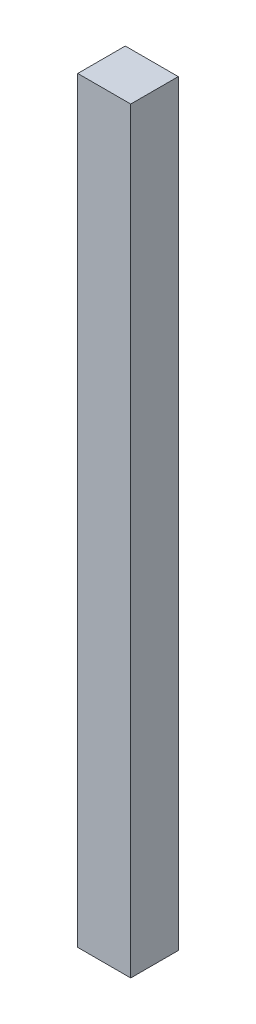
ISO-10303-21;
HEADER;
FILE_DESCRIPTION(('STEP AP214'),'2;1');
FILE_NAME('part.step','',(''),(''),'','','');
FILE_SCHEMA(('AUTOMOTIVE_DESIGN { 1 0 10303 214 1 1 1 1 }'));
ENDSEC;
DATA;
#1=APPLICATION_CONTEXT('core data for automotive mechanical design processes');
#2=APPLICATION_PROTOCOL_DEFINITION('international standard','automotive_design',2000,#1);
#3=PRODUCT_CONTEXT('',#1,'mechanical');
#4=PRODUCT('Part','Part','',(#3));
#5=PRODUCT_RELATED_PRODUCT_CATEGORY('part','',(#4));
#6=PRODUCT_DEFINITION_FORMATION('','',#4);
#7=PRODUCT_DEFINITION_CONTEXT('part definition',#1,'design');
#8=PRODUCT_DEFINITION('design','',#6,#7);
#9=PRODUCT_DEFINITION_SHAPE('','',#8);
#10=(LENGTH_UNIT() NAMED_UNIT(*) SI_UNIT(.MILLI.,.METRE.));
#11=(NAMED_UNIT(*) PLANE_ANGLE_UNIT() SI_UNIT($,.RADIAN.));
#12=(NAMED_UNIT(*) SI_UNIT($,.STERADIAN.) SOLID_ANGLE_UNIT());
#13=UNCERTAINTY_MEASURE_WITH_UNIT(LENGTH_MEASURE(1.E-05),#10,'distance_accuracy_value','');
#14=(GEOMETRIC_REPRESENTATION_CONTEXT(3) GLOBAL_UNCERTAINTY_ASSIGNED_CONTEXT((#13)) GLOBAL_UNIT_ASSIGNED_CONTEXT((#10,
#11,#12)) REPRESENTATION_CONTEXT('',''));
#15=CARTESIAN_POINT('',(0.,0.,0.));
#16=DIRECTION('',(0.,0.,1.));
#17=DIRECTION('',(1.,0.,0.));
#18=AXIS2_PLACEMENT_3D('',#15,#16,#17);
#19=CARTESIAN_POINT('',(0.,0.,6.28));
#20=DIRECTION('',(1.,0.,0.));
#21=DIRECTION('',(0.,0.,-1.));
#22=AXIS2_PLACEMENT_3D('',#19,#20,#21);
#23=PLANE('',#22);
#24=DIRECTION('',(0.,-1.,0.));
#25=VECTOR('',#24,1.);
#26=CARTESIAN_POINT('',(0.,0.,0.));
#27=LINE('',#26,#25);
#28=CARTESIAN_POINT('',(0.,100.,0.));
#29=VERTEX_POINT('',#28);
#30=CARTESIAN_POINT('',(0.,0.,0.));
#31=VERTEX_POINT('',#30);
#32=EDGE_CURVE('E107',#29,#31,#27,.T.);
#33=ORIENTED_EDGE('',*,*,#32,.T.);
#34=DIRECTION('',(0.,0.,-1.));
#35=VECTOR('',#34,1.);
#36=CARTESIAN_POINT('',(0.,0.,6.28));
#37=LINE('',#36,#35);
#38=CARTESIAN_POINT('',(0.,0.,6.28));
#39=VERTEX_POINT('',#38);
#40=EDGE_CURVE('E11',#39,#31,#37,.T.);
#41=ORIENTED_EDGE('',*,*,#40,.F.);
#42=DIRECTION('',(0.,-1.,0.));
#43=VECTOR('',#42,1.);
#44=CARTESIAN_POINT('',(0.,0.,6.28));
#45=LINE('',#44,#43);
#46=CARTESIAN_POINT('',(0.,100.,6.28));
#47=VERTEX_POINT('',#46);
#48=EDGE_CURVE('E91',#47,#39,#45,.T.);
#49=ORIENTED_EDGE('',*,*,#48,.F.);
#50=DIRECTION('',(0.,0.,-1.));
#51=VECTOR('',#50,1.);
#52=CARTESIAN_POINT('',(0.,100.,6.28));
#53=LINE('',#52,#51);
#54=EDGE_CURVE('E103',#47,#29,#53,.T.);
#55=ORIENTED_EDGE('',*,*,#54,.T.);
#56=EDGE_LOOP('',(#33,#41,#49,#55));
#57=FACE_BOUND('',#56,.T.);
#58=ADVANCED_FACE('F39',(#57),#23,.F.);
#59=CARTESIAN_POINT('',(0.,0.,6.28));
#60=DIRECTION('',(0.,1.,0.));
#61=DIRECTION('',(-1.,0.,0.));
#62=AXIS2_PLACEMENT_3D('',#59,#60,#61);
#63=PLANE('',#62);
#64=DIRECTION('',(1.,0.,0.));
#65=VECTOR('',#64,1.);
#66=CARTESIAN_POINT('',(0.,0.,0.));
#67=LINE('',#66,#65);
#68=CARTESIAN_POINT('',(7.,0.,0.));
#69=VERTEX_POINT('',#68);
#70=EDGE_CURVE('E96',#31,#69,#67,.T.);
#71=ORIENTED_EDGE('',*,*,#70,.T.);
#72=DIRECTION('',(0.,0.,-1.));
#73=VECTOR('',#72,1.);
#74=CARTESIAN_POINT('',(7.,0.,6.28));
#75=LINE('',#74,#73);
#76=CARTESIAN_POINT('',(7.,0.,6.28));
#77=VERTEX_POINT('',#76);
#78=EDGE_CURVE('E48',#77,#69,#75,.T.);
#79=ORIENTED_EDGE('',*,*,#78,.F.);
#80=DIRECTION('',(1.,0.,0.));
#81=VECTOR('',#80,1.);
#82=CARTESIAN_POINT('',(0.,0.,6.28));
#83=LINE('',#82,#81);
#84=EDGE_CURVE('E86',#39,#77,#83,.T.);
#85=ORIENTED_EDGE('',*,*,#84,.F.);
#86=ORIENTED_EDGE('',*,*,#40,.T.);
#87=EDGE_LOOP('',(#71,#79,#85,#86));
#88=FACE_BOUND('',#87,.T.);
#89=ADVANCED_FACE('F95',(#88),#63,.F.);
#90=CARTESIAN_POINT('',(7.,0.,6.28));
#91=DIRECTION('',(-1.,0.,0.));
#92=DIRECTION('',(0.,-1.,0.));
#93=AXIS2_PLACEMENT_3D('',#90,#91,#92);
#94=PLANE('',#93);
#95=DIRECTION('',(0.,1.,0.));
#96=VECTOR('',#95,1.);
#97=CARTESIAN_POINT('',(7.,0.,0.));
#98=LINE('',#97,#96);
#99=CARTESIAN_POINT('',(6.99999999999997,100.,0.));
#100=VERTEX_POINT('',#99);
#101=EDGE_CURVE('E73',#69,#100,#98,.T.);
#102=ORIENTED_EDGE('',*,*,#101,.T.);
#103=DIRECTION('',(0.,0.,-1.));
#104=VECTOR('',#103,1.);
#105=CARTESIAN_POINT('',(6.99999999999997,100.,6.28));
#106=LINE('',#105,#104);
#107=CARTESIAN_POINT('',(6.99999999999997,100.,6.28));
#108=VERTEX_POINT('',#107);
#109=EDGE_CURVE('E98',#108,#100,#106,.T.);
#110=ORIENTED_EDGE('',*,*,#109,.F.);
#111=DIRECTION('',(0.,1.,0.));
#112=VECTOR('',#111,1.);
#113=CARTESIAN_POINT('',(7.,0.,6.28));
#114=LINE('',#113,#112);
#115=EDGE_CURVE('E89',#77,#108,#114,.T.);
#116=ORIENTED_EDGE('',*,*,#115,.F.);
#117=ORIENTED_EDGE('',*,*,#78,.T.);
#118=EDGE_LOOP('',(#102,#110,#116,#117));
#119=FACE_BOUND('',#118,.T.);
#120=ADVANCED_FACE('F99',(#119),#94,.F.);
#121=CARTESIAN_POINT('',(0.,100.,6.28));
#122=DIRECTION('',(0.,-1.,0.));
#123=DIRECTION('',(0.,0.,-1.));
#124=AXIS2_PLACEMENT_3D('',#121,#122,#123);
#125=PLANE('',#124);
#126=DIRECTION('',(-1.,0.,0.));
#127=VECTOR('',#126,1.);
#128=CARTESIAN_POINT('',(0.,100.,0.));
#129=LINE('',#128,#127);
#130=EDGE_CURVE('E79',#100,#29,#129,.T.);
#131=ORIENTED_EDGE('',*,*,#130,.T.);
#132=ORIENTED_EDGE('',*,*,#54,.F.);
#133=DIRECTION('',(-1.,0.,0.));
#134=VECTOR('',#133,1.);
#135=CARTESIAN_POINT('',(0.,100.,6.28));
#136=LINE('',#135,#134);
#137=EDGE_CURVE('E56',#108,#47,#136,.T.);
#138=ORIENTED_EDGE('',*,*,#137,.F.);
#139=ORIENTED_EDGE('',*,*,#109,.T.);
#140=EDGE_LOOP('',(#131,#132,#138,#139));
#141=FACE_BOUND('',#140,.T.);
#142=ADVANCED_FACE('F120',(#141),#125,.F.);
#143=CARTESIAN_POINT('',(0.,0.,6.28));
#144=DIRECTION('',(0.,0.,-1.));
#145=DIRECTION('',(-1.,0.,0.));
#146=AXIS2_PLACEMENT_3D('',#143,#144,#145);
#147=PLANE('',#146);
#148=ORIENTED_EDGE('',*,*,#48,.T.);
#149=ORIENTED_EDGE('',*,*,#84,.T.);
#150=ORIENTED_EDGE('',*,*,#115,.T.);
#151=ORIENTED_EDGE('',*,*,#137,.T.);
#152=EDGE_LOOP('',(#148,#149,#150,#151));
#153=FACE_BOUND('',#152,.T.);
#154=ADVANCED_FACE('F87',(#153),#147,.F.);
#155=CARTESIAN_POINT('',(0.,0.,0.));
#156=DIRECTION('',(0.,0.,-1.));
#157=DIRECTION('',(-1.,0.,0.));
#158=AXIS2_PLACEMENT_3D('',#155,#156,#157);
#159=PLANE('',#158);
#160=ORIENTED_EDGE('',*,*,#32,.F.);
#161=ORIENTED_EDGE('',*,*,#130,.F.);
#162=ORIENTED_EDGE('',*,*,#101,.F.);
#163=ORIENTED_EDGE('',*,*,#70,.F.);
#164=EDGE_LOOP('',(#160,#161,#162,#163));
#165=FACE_BOUND('',#164,.T.);
#166=ADVANCED_FACE('F123',(#165),#159,.T.);
#167=CLOSED_SHELL('',(#58,#89,#120,#142,#154,#166));
#168=MANIFOLD_SOLID_BREP('B2',#167);
#169=ADVANCED_BREP_SHAPE_REPRESENTATION('',(#18,#168),#14);
#170=SHAPE_DEFINITION_REPRESENTATION(#9,#169);
ENDSEC;
END-ISO-10303-21;
